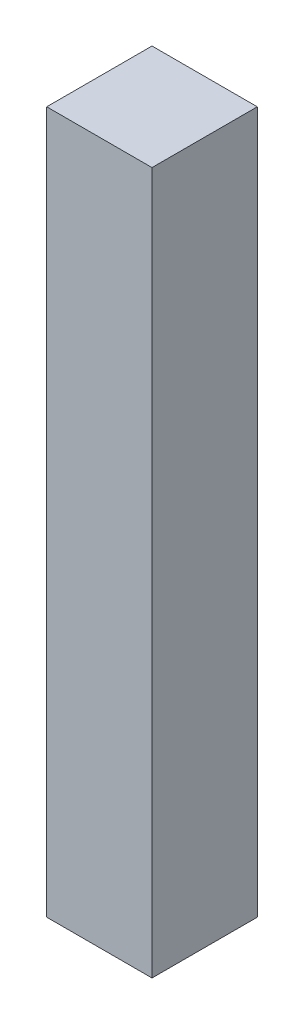
ISO-10303-21;
HEADER;
FILE_DESCRIPTION(('STEP AP214'),'2;1');
FILE_NAME('part.step','',(''),(''),'','','');
FILE_SCHEMA(('AUTOMOTIVE_DESIGN { 1 0 10303 214 1 1 1 1 }'));
ENDSEC;
DATA;
#1=APPLICATION_CONTEXT('core data for automotive mechanical design processes');
#2=APPLICATION_PROTOCOL_DEFINITION('international standard','automotive_design',2000,#1);
#3=PRODUCT_CONTEXT('',#1,'mechanical');
#4=PRODUCT('Part','Part','',(#3));
#5=PRODUCT_RELATED_PRODUCT_CATEGORY('part','',(#4));
#6=PRODUCT_DEFINITION_FORMATION('','',#4);
#7=PRODUCT_DEFINITION_CONTEXT('part definition',#1,'design');
#8=PRODUCT_DEFINITION('design','',#6,#7);
#9=PRODUCT_DEFINITION_SHAPE('','',#8);
#10=(LENGTH_UNIT() NAMED_UNIT(*) SI_UNIT(.MILLI.,.METRE.));
#11=(NAMED_UNIT(*) PLANE_ANGLE_UNIT() SI_UNIT($,.RADIAN.));
#12=(NAMED_UNIT(*) SI_UNIT($,.STERADIAN.) SOLID_ANGLE_UNIT());
#13=UNCERTAINTY_MEASURE_WITH_UNIT(LENGTH_MEASURE(1.E-05),#10,'distance_accuracy_value','');
#14=(GEOMETRIC_REPRESENTATION_CONTEXT(3) GLOBAL_UNCERTAINTY_ASSIGNED_CONTEXT((#13)) GLOBAL_UNIT_ASSIGNED_CONTEXT((#10,
#11,#12)) REPRESENTATION_CONTEXT('',''));
#15=CARTESIAN_POINT('',(0.,0.,0.));
#16=DIRECTION('',(0.,0.,1.));
#17=DIRECTION('',(1.,0.,0.));
#18=AXIS2_PLACEMENT_3D('',#15,#16,#17);
#19=CARTESIAN_POINT('',(30.,400.,30.));
#20=DIRECTION('',(-1.,0.,0.));
#21=DIRECTION('',(0.,0.,1.));
#22=AXIS2_PLACEMENT_3D('',#19,#20,#21);
#23=PLANE('',#22);
#24=DIRECTION('',(0.,0.,-1.));
#25=VECTOR('',#24,1.);
#26=CARTESIAN_POINT('',(30.,0.,30.));
#27=LINE('',#26,#25);
#28=CARTESIAN_POINT('',(30.,0.,30.));
#29=VERTEX_POINT('',#28);
#30=CARTESIAN_POINT('',(30.,0.,-30.));
#31=VERTEX_POINT('',#30);
#32=EDGE_CURVE('E98',#29,#31,#27,.T.);
#33=ORIENTED_EDGE('',*,*,#32,.T.);
#34=DIRECTION('',(0.,-1.,0.));
#35=VECTOR('',#34,1.);
#36=CARTESIAN_POINT('',(30.,400.,-30.));
#37=LINE('',#36,#35);
#38=CARTESIAN_POINT('',(30.,400.,-30.));
#39=VERTEX_POINT('',#38);
#40=EDGE_CURVE('E11',#39,#31,#37,.T.);
#41=ORIENTED_EDGE('',*,*,#40,.F.);
#42=DIRECTION('',(0.,0.,-1.));
#43=VECTOR('',#42,1.);
#44=CARTESIAN_POINT('',(30.,400.,30.));
#45=LINE('',#44,#43);
#46=CARTESIAN_POINT('',(30.,400.,30.));
#47=VERTEX_POINT('',#46);
#48=EDGE_CURVE('E86',#47,#39,#45,.T.);
#49=ORIENTED_EDGE('',*,*,#48,.F.);
#50=DIRECTION('',(0.,-1.,0.));
#51=VECTOR('',#50,1.);
#52=CARTESIAN_POINT('',(30.,400.,30.));
#53=LINE('',#52,#51);
#54=EDGE_CURVE('E94',#47,#29,#53,.T.);
#55=ORIENTED_EDGE('',*,*,#54,.T.);
#56=EDGE_LOOP('',(#33,#41,#49,#55));
#57=FACE_BOUND('',#56,.T.);
#58=ADVANCED_FACE('F35',(#57),#23,.F.);
#59=CARTESIAN_POINT('',(-30.,400.,-30.));
#60=DIRECTION('',(0.,0.,1.));
#61=DIRECTION('',(1.,0.,0.));
#62=AXIS2_PLACEMENT_3D('',#59,#60,#61);
#63=PLANE('',#62);
#64=DIRECTION('',(-1.,0.,0.));
#65=VECTOR('',#64,1.);
#66=CARTESIAN_POINT('',(-30.,0.,-30.));
#67=LINE('',#66,#65);
#68=CARTESIAN_POINT('',(-30.,0.,-30.));
#69=VERTEX_POINT('',#68);
#70=EDGE_CURVE('E90',#31,#69,#67,.T.);
#71=ORIENTED_EDGE('',*,*,#70,.T.);
#72=DIRECTION('',(0.,-1.,0.));
#73=VECTOR('',#72,1.);
#74=CARTESIAN_POINT('',(-30.,400.,-30.));
#75=LINE('',#74,#73);
#76=CARTESIAN_POINT('',(-30.,400.,-30.));
#77=VERTEX_POINT('',#76);
#78=EDGE_CURVE('E43',#77,#69,#75,.T.);
#79=ORIENTED_EDGE('',*,*,#78,.F.);
#80=DIRECTION('',(-1.,0.,0.));
#81=VECTOR('',#80,1.);
#82=CARTESIAN_POINT('',(-30.,400.,-30.));
#83=LINE('',#82,#81);
#84=EDGE_CURVE('E81',#39,#77,#83,.T.);
#85=ORIENTED_EDGE('',*,*,#84,.F.);
#86=ORIENTED_EDGE('',*,*,#40,.T.);
#87=EDGE_LOOP('',(#71,#79,#85,#86));
#88=FACE_BOUND('',#87,.T.);
#89=ADVANCED_FACE('F89',(#88),#63,.F.);
#90=CARTESIAN_POINT('',(-30.,400.,30.));
#91=DIRECTION('',(1.,0.,0.));
#92=DIRECTION('',(0.,0.,-1.));
#93=AXIS2_PLACEMENT_3D('',#90,#91,#92);
#94=PLANE('',#93);
#95=DIRECTION('',(0.,0.,1.));
#96=VECTOR('',#95,1.);
#97=CARTESIAN_POINT('',(-30.,0.,30.));
#98=LINE('',#97,#96);
#99=CARTESIAN_POINT('',(-30.,0.,30.));
#100=VERTEX_POINT('',#99);
#101=EDGE_CURVE('E68',#69,#100,#98,.T.);
#102=ORIENTED_EDGE('',*,*,#101,.T.);
#103=DIRECTION('',(0.,-1.,0.));
#104=VECTOR('',#103,1.);
#105=CARTESIAN_POINT('',(-30.,400.,30.));
#106=LINE('',#105,#104);
#107=CARTESIAN_POINT('',(-30.,400.,30.));
#108=VERTEX_POINT('',#107);
#109=EDGE_CURVE('E91',#108,#100,#106,.T.);
#110=ORIENTED_EDGE('',*,*,#109,.F.);
#111=DIRECTION('',(0.,0.,1.));
#112=VECTOR('',#111,1.);
#113=CARTESIAN_POINT('',(-30.,400.,30.));
#114=LINE('',#113,#112);
#115=EDGE_CURVE('E84',#77,#108,#114,.T.);
#116=ORIENTED_EDGE('',*,*,#115,.F.);
#117=ORIENTED_EDGE('',*,*,#78,.T.);
#118=EDGE_LOOP('',(#102,#110,#116,#117));
#119=FACE_BOUND('',#118,.T.);
#120=ADVANCED_FACE('F92',(#119),#94,.F.);
#121=CARTESIAN_POINT('',(-30.,400.,30.));
#122=DIRECTION('',(0.,0.,-1.));
#123=DIRECTION('',(-1.,0.,0.));
#124=AXIS2_PLACEMENT_3D('',#121,#122,#123);
#125=PLANE('',#124);
#126=DIRECTION('',(1.,0.,0.));
#127=VECTOR('',#126,1.);
#128=CARTESIAN_POINT('',(-30.,0.,30.));
#129=LINE('',#128,#127);
#130=EDGE_CURVE('E74',#100,#29,#129,.T.);
#131=ORIENTED_EDGE('',*,*,#130,.T.);
#132=ORIENTED_EDGE('',*,*,#54,.F.);
#133=DIRECTION('',(1.,0.,0.));
#134=VECTOR('',#133,1.);
#135=CARTESIAN_POINT('',(-30.,400.,30.));
#136=LINE('',#135,#134);
#137=EDGE_CURVE('E51',#108,#47,#136,.T.);
#138=ORIENTED_EDGE('',*,*,#137,.F.);
#139=ORIENTED_EDGE('',*,*,#109,.T.);
#140=EDGE_LOOP('',(#131,#132,#138,#139));
#141=FACE_BOUND('',#140,.T.);
#142=ADVANCED_FACE('F105',(#141),#125,.F.);
#143=CARTESIAN_POINT('',(0.,400.,0.));
#144=DIRECTION('',(0.,-1.,0.));
#145=DIRECTION('',(0.,0.,-1.));
#146=AXIS2_PLACEMENT_3D('',#143,#144,#145);
#147=PLANE('',#146);
#148=ORIENTED_EDGE('',*,*,#48,.T.);
#149=ORIENTED_EDGE('',*,*,#84,.T.);
#150=ORIENTED_EDGE('',*,*,#115,.T.);
#151=ORIENTED_EDGE('',*,*,#137,.T.);
#152=EDGE_LOOP('',(#148,#149,#150,#151));
#153=FACE_BOUND('',#152,.T.);
#154=ADVANCED_FACE('F82',(#153),#147,.F.);
#155=CARTESIAN_POINT('',(0.,0.,0.));
#156=DIRECTION('',(0.,-1.,0.));
#157=DIRECTION('',(0.,0.,-1.));
#158=AXIS2_PLACEMENT_3D('',#155,#156,#157);
#159=PLANE('',#158);
#160=ORIENTED_EDGE('',*,*,#32,.F.);
#161=ORIENTED_EDGE('',*,*,#130,.F.);
#162=ORIENTED_EDGE('',*,*,#101,.F.);
#163=ORIENTED_EDGE('',*,*,#70,.F.);
#164=EDGE_LOOP('',(#160,#161,#162,#163));
#165=FACE_BOUND('',#164,.T.);
#166=ADVANCED_FACE('F108',(#165),#159,.T.);
#167=CLOSED_SHELL('',(#58,#89,#120,#142,#154,#166));
#168=MANIFOLD_SOLID_BREP('B2',#167);
#169=ADVANCED_BREP_SHAPE_REPRESENTATION('',(#18,#168),#14);
#170=SHAPE_DEFINITION_REPRESENTATION(#9,#169);
ENDSEC;
END-ISO-10303-21;
